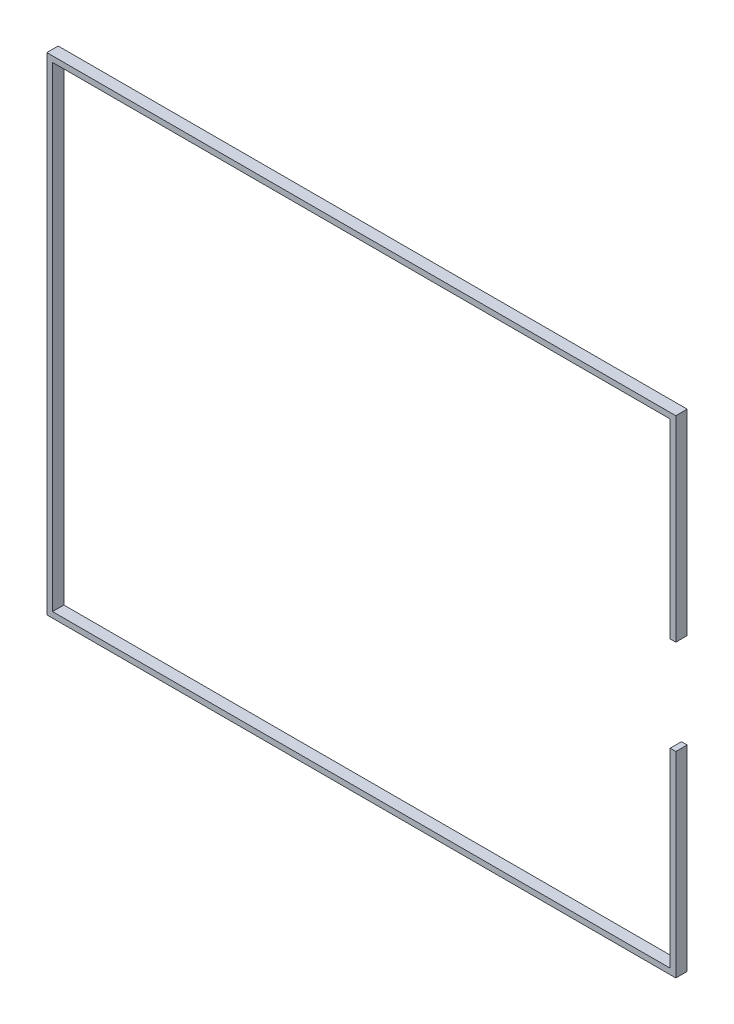
ISO-10303-21;
HEADER;
FILE_DESCRIPTION(('STEP AP214'),'2;1');
FILE_NAME('part.step','',(''),(''),'','','');
FILE_SCHEMA(('AUTOMOTIVE_DESIGN { 1 0 10303 214 1 1 1 1 }'));
ENDSEC;
DATA;
#1=APPLICATION_CONTEXT('core data for automotive mechanical design processes');
#2=APPLICATION_PROTOCOL_DEFINITION('international standard','automotive_design',2000,#1);
#3=PRODUCT_CONTEXT('',#1,'mechanical');
#4=PRODUCT('Part','Part','',(#3));
#5=PRODUCT_RELATED_PRODUCT_CATEGORY('part','',(#4));
#6=PRODUCT_DEFINITION_FORMATION('','',#4);
#7=PRODUCT_DEFINITION_CONTEXT('part definition',#1,'design');
#8=PRODUCT_DEFINITION('design','',#6,#7);
#9=PRODUCT_DEFINITION_SHAPE('','',#8);
#10=(LENGTH_UNIT() NAMED_UNIT(*) SI_UNIT(.MILLI.,.METRE.));
#11=(NAMED_UNIT(*) PLANE_ANGLE_UNIT() SI_UNIT($,.RADIAN.));
#12=(NAMED_UNIT(*) SI_UNIT($,.STERADIAN.) SOLID_ANGLE_UNIT());
#13=UNCERTAINTY_MEASURE_WITH_UNIT(LENGTH_MEASURE(1.E-05),#10,'distance_accuracy_value','');
#14=(GEOMETRIC_REPRESENTATION_CONTEXT(3) GLOBAL_UNCERTAINTY_ASSIGNED_CONTEXT((#13)) GLOBAL_UNIT_ASSIGNED_CONTEXT((#10,
#11,#12)) REPRESENTATION_CONTEXT('',''));
#15=CARTESIAN_POINT('',(0.,0.,0.));
#16=DIRECTION('',(0.,0.,1.));
#17=DIRECTION('',(1.,0.,0.));
#18=AXIS2_PLACEMENT_3D('',#15,#16,#17);
#19=CARTESIAN_POINT('',(166.1,0.,-5.));
#20=DIRECTION('',(1.,0.,0.));
#21=DIRECTION('',(0.,0.,-1.));
#22=AXIS2_PLACEMENT_3D('',#19,#20,#21);
#23=PLANE('',#22);
#24=DIRECTION('',(0.,-1.,0.));
#25=VECTOR('',#24,1.);
#26=CARTESIAN_POINT('',(166.1,0.,0.));
#27=LINE('',#26,#25);
#28=CARTESIAN_POINT('',(166.1,128.6,0.));
#29=VERTEX_POINT('',#28);
#30=CARTESIAN_POINT('',(166.1,25.,0.));
#31=VERTEX_POINT('',#30);
#32=EDGE_CURVE('E178',#29,#31,#27,.T.);
#33=ORIENTED_EDGE('',*,*,#32,.F.);
#34=DIRECTION('',(0.,0.,1.));
#35=VECTOR('',#34,1.);
#36=CARTESIAN_POINT('',(166.1,128.6,-5.));
#37=LINE('',#36,#35);
#38=CARTESIAN_POINT('',(166.1,128.6,6.));
#39=VERTEX_POINT('',#38);
#40=EDGE_CURVE('E210',#29,#39,#37,.T.);
#41=ORIENTED_EDGE('',*,*,#40,.T.);
#42=DIRECTION('',(0.,1.,0.));
#43=VECTOR('',#42,1.);
#44=CARTESIAN_POINT('',(166.1,0.,6.));
#45=LINE('',#44,#43);
#46=CARTESIAN_POINT('',(166.1,25.,6.));
#47=VERTEX_POINT('',#46);
#48=EDGE_CURVE('E187',#47,#39,#45,.T.);
#49=ORIENTED_EDGE('',*,*,#48,.F.);
#50=DIRECTION('',(0.,0.,-1.));
#51=VECTOR('',#50,1.);
#52=CARTESIAN_POINT('',(166.1,25.,6.));
#53=LINE('',#52,#51);
#54=EDGE_CURVE('E207',#47,#31,#53,.T.);
#55=ORIENTED_EDGE('',*,*,#54,.T.);
#56=EDGE_LOOP('',(#33,#41,#49,#55));
#57=FACE_BOUND('',#56,.T.);
#58=ADVANCED_FACE('F40',(#57),#23,.T.);
#59=CARTESIAN_POINT('',(0.,-128.6,-5.));
#60=DIRECTION('',(0.,-1.,0.));
#61=DIRECTION('',(0.,0.,-1.));
#62=AXIS2_PLACEMENT_3D('',#59,#60,#61);
#63=PLANE('',#62);
#64=DIRECTION('',(-1.,0.,0.));
#65=VECTOR('',#64,1.);
#66=CARTESIAN_POINT('',(0.,-128.6,0.));
#67=LINE('',#66,#65);
#68=CARTESIAN_POINT('',(166.1,-128.6,0.));
#69=VERTEX_POINT('',#68);
#70=CARTESIAN_POINT('',(-166.1,-128.6,0.));
#71=VERTEX_POINT('',#70);
#72=EDGE_CURVE('E177',#69,#71,#67,.T.);
#73=ORIENTED_EDGE('',*,*,#72,.F.);
#74=DIRECTION('',(0.,0.,1.));
#75=VECTOR('',#74,1.);
#76=CARTESIAN_POINT('',(166.1,-128.6,-5.));
#77=LINE('',#76,#75);
#78=CARTESIAN_POINT('',(166.1,-128.6,6.));
#79=VERTEX_POINT('',#78);
#80=EDGE_CURVE('E44',#69,#79,#77,.T.);
#81=ORIENTED_EDGE('',*,*,#80,.T.);
#82=DIRECTION('',(1.,0.,0.));
#83=VECTOR('',#82,1.);
#84=CARTESIAN_POINT('',(0.,-128.6,6.));
#85=LINE('',#84,#83);
#86=CARTESIAN_POINT('',(-166.1,-128.6,6.));
#87=VERTEX_POINT('',#86);
#88=EDGE_CURVE('E198',#87,#79,#85,.T.);
#89=ORIENTED_EDGE('',*,*,#88,.F.);
#90=DIRECTION('',(0.,0.,1.));
#91=VECTOR('',#90,1.);
#92=CARTESIAN_POINT('',(-166.1,-128.6,-5.));
#93=LINE('',#92,#91);
#94=EDGE_CURVE('E11',#71,#87,#93,.T.);
#95=ORIENTED_EDGE('',*,*,#94,.F.);
#96=EDGE_LOOP('',(#73,#81,#89,#95));
#97=FACE_BOUND('',#96,.T.);
#98=ADVANCED_FACE('F42',(#97),#63,.T.);
#99=CARTESIAN_POINT('',(-166.1,0.,-5.));
#100=DIRECTION('',(-1.,0.,0.));
#101=DIRECTION('',(0.,0.,1.));
#102=AXIS2_PLACEMENT_3D('',#99,#100,#101);
#103=PLANE('',#102);
#104=DIRECTION('',(0.,1.,0.));
#105=VECTOR('',#104,1.);
#106=CARTESIAN_POINT('',(-166.1,0.,0.));
#107=LINE('',#106,#105);
#108=CARTESIAN_POINT('',(-166.1,128.6,0.));
#109=VERTEX_POINT('',#108);
#110=EDGE_CURVE('E180',#71,#109,#107,.T.);
#111=ORIENTED_EDGE('',*,*,#110,.F.);
#112=ORIENTED_EDGE('',*,*,#94,.T.);
#113=DIRECTION('',(0.,-1.,0.));
#114=VECTOR('',#113,1.);
#115=CARTESIAN_POINT('',(-166.1,0.,6.));
#116=LINE('',#115,#114);
#117=CARTESIAN_POINT('',(-166.1,128.6,6.));
#118=VERTEX_POINT('',#117);
#119=EDGE_CURVE('E195',#118,#87,#116,.T.);
#120=ORIENTED_EDGE('',*,*,#119,.F.);
#121=DIRECTION('',(0.,0.,1.));
#122=VECTOR('',#121,1.);
#123=CARTESIAN_POINT('',(-166.1,128.6,-5.));
#124=LINE('',#123,#122);
#125=EDGE_CURVE('E49',#109,#118,#124,.T.);
#126=ORIENTED_EDGE('',*,*,#125,.F.);
#127=EDGE_LOOP('',(#111,#112,#120,#126));
#128=FACE_BOUND('',#127,.T.);
#129=ADVANCED_FACE('F233',(#128),#103,.T.);
#130=CARTESIAN_POINT('',(0.,128.6,-5.));
#131=DIRECTION('',(0.,-1.,0.));
#132=DIRECTION('',(0.,0.,-1.));
#133=AXIS2_PLACEMENT_3D('',#130,#131,#132);
#134=PLANE('',#133);
#135=ORIENTED_EDGE('',*,*,#40,.F.);
#136=DIRECTION('',(-1.,0.,0.));
#137=VECTOR('',#136,1.);
#138=CARTESIAN_POINT('',(0.,128.6,0.));
#139=LINE('',#138,#137);
#140=EDGE_CURVE('E182',#29,#109,#139,.T.);
#141=ORIENTED_EDGE('',*,*,#140,.T.);
#142=ORIENTED_EDGE('',*,*,#125,.T.);
#143=DIRECTION('',(-1.,0.,0.));
#144=VECTOR('',#143,1.);
#145=CARTESIAN_POINT('',(0.,128.6,6.));
#146=LINE('',#145,#144);
#147=EDGE_CURVE('E191',#39,#118,#146,.T.);
#148=ORIENTED_EDGE('',*,*,#147,.F.);
#149=EDGE_LOOP('',(#135,#141,#142,#148));
#150=FACE_BOUND('',#149,.T.);
#151=ADVANCED_FACE('F236',(#150),#134,.F.);
#152=CARTESIAN_POINT('',(166.1,-25.,0.));
#153=VERTEX_POINT('',#152);
#154=EDGE_CURVE('E168',#153,#69,#27,.T.);
#155=ORIENTED_EDGE('',*,*,#154,.F.);
#156=DIRECTION('',(0.,0.,-1.));
#157=VECTOR('',#156,1.);
#158=CARTESIAN_POINT('',(166.1,-25.,6.));
#159=LINE('',#158,#157);
#160=CARTESIAN_POINT('',(166.1,-25.,6.));
#161=VERTEX_POINT('',#160);
#162=EDGE_CURVE('E202',#161,#153,#159,.T.);
#163=ORIENTED_EDGE('',*,*,#162,.F.);
#164=EDGE_CURVE('E192',#79,#161,#45,.T.);
#165=ORIENTED_EDGE('',*,*,#164,.F.);
#166=ORIENTED_EDGE('',*,*,#80,.F.);
#167=EDGE_LOOP('',(#155,#163,#165,#166));
#168=FACE_BOUND('',#167,.T.);
#169=ADVANCED_FACE('F228',(#168),#23,.T.);
#170=CARTESIAN_POINT('',(0.,25.,6.));
#171=DIRECTION('',(0.,1.,0.));
#172=DIRECTION('',(0.,0.,1.));
#173=AXIS2_PLACEMENT_3D('',#170,#171,#172);
#174=PLANE('',#173);
#175=DIRECTION('',(1.,0.,0.));
#176=VECTOR('',#175,1.);
#177=CARTESIAN_POINT('',(0.,25.,6.));
#178=LINE('',#177,#176);
#179=CARTESIAN_POINT('',(163.1,25.,6.));
#180=VERTEX_POINT('',#179);
#181=EDGE_CURVE('E185',#180,#47,#178,.T.);
#182=ORIENTED_EDGE('',*,*,#181,.F.);
#183=DIRECTION('',(0.,0.,1.));
#184=VECTOR('',#183,1.);
#185=CARTESIAN_POINT('',(163.1,25.,0.));
#186=LINE('',#185,#184);
#187=CARTESIAN_POINT('',(163.1,25.,0.));
#188=VERTEX_POINT('',#187);
#189=EDGE_CURVE('E173',#188,#180,#186,.T.);
#190=ORIENTED_EDGE('',*,*,#189,.F.);
#191=DIRECTION('',(1.,0.,0.));
#192=VECTOR('',#191,1.);
#193=CARTESIAN_POINT('',(0.,25.,0.));
#194=LINE('',#193,#192);
#195=EDGE_CURVE('E203',#188,#31,#194,.T.);
#196=ORIENTED_EDGE('',*,*,#195,.T.);
#197=ORIENTED_EDGE('',*,*,#54,.F.);
#198=EDGE_LOOP('',(#182,#190,#196,#197));
#199=FACE_BOUND('',#198,.T.);
#200=ADVANCED_FACE('F241',(#199),#174,.F.);
#201=CARTESIAN_POINT('',(0.,-25.,6.));
#202=DIRECTION('',(0.,1.,0.));
#203=DIRECTION('',(0.,0.,1.));
#204=AXIS2_PLACEMENT_3D('',#201,#202,#203);
#205=PLANE('',#204);
#206=DIRECTION('',(0.,0.,1.));
#207=VECTOR('',#206,1.);
#208=CARTESIAN_POINT('',(163.1,-25.,0.));
#209=LINE('',#208,#207);
#210=CARTESIAN_POINT('',(163.1,-25.,0.));
#211=VERTEX_POINT('',#210);
#212=CARTESIAN_POINT('',(163.1,-25.,6.));
#213=VERTEX_POINT('',#212);
#214=EDGE_CURVE('E57',#211,#213,#209,.T.);
#215=ORIENTED_EDGE('',*,*,#214,.T.);
#216=DIRECTION('',(1.,0.,0.));
#217=VECTOR('',#216,1.);
#218=CARTESIAN_POINT('',(0.,-25.,6.));
#219=LINE('',#218,#217);
#220=EDGE_CURVE('E64',#213,#161,#219,.T.);
#221=ORIENTED_EDGE('',*,*,#220,.T.);
#222=ORIENTED_EDGE('',*,*,#162,.T.);
#223=DIRECTION('',(1.,0.,0.));
#224=VECTOR('',#223,1.);
#225=CARTESIAN_POINT('',(0.,-25.,0.));
#226=LINE('',#225,#224);
#227=EDGE_CURVE('E188',#211,#153,#226,.T.);
#228=ORIENTED_EDGE('',*,*,#227,.F.);
#229=EDGE_LOOP('',(#215,#221,#222,#228));
#230=FACE_BOUND('',#229,.T.);
#231=ADVANCED_FACE('F229',(#230),#205,.T.);
#232=CARTESIAN_POINT('',(0.,0.,6.));
#233=DIRECTION('',(0.,0.,1.));
#234=DIRECTION('',(1.,0.,0.));
#235=AXIS2_PLACEMENT_3D('',#232,#233,#234);
#236=PLANE('',#235);
#237=DIRECTION('',(0.,1.,0.));
#238=VECTOR('',#237,1.);
#239=CARTESIAN_POINT('',(163.1,0.,6.));
#240=LINE('',#239,#238);
#241=CARTESIAN_POINT('',(163.1,125.6,6.));
#242=VERTEX_POINT('',#241);
#243=EDGE_CURVE('E163',#180,#242,#240,.T.);
#244=ORIENTED_EDGE('',*,*,#243,.F.);
#245=ORIENTED_EDGE('',*,*,#181,.T.);
#246=ORIENTED_EDGE('',*,*,#48,.T.);
#247=ORIENTED_EDGE('',*,*,#147,.T.);
#248=ORIENTED_EDGE('',*,*,#119,.T.);
#249=ORIENTED_EDGE('',*,*,#88,.T.);
#250=ORIENTED_EDGE('',*,*,#164,.T.);
#251=ORIENTED_EDGE('',*,*,#220,.F.);
#252=CARTESIAN_POINT('',(163.1,-125.6,6.));
#253=VERTEX_POINT('',#252);
#254=EDGE_CURVE('E161',#253,#213,#240,.T.);
#255=ORIENTED_EDGE('',*,*,#254,.F.);
#256=DIRECTION('',(1.,0.,0.));
#257=VECTOR('',#256,1.);
#258=CARTESIAN_POINT('',(0.,-125.6,6.));
#259=LINE('',#258,#257);
#260=CARTESIAN_POINT('',(-163.1,-125.6,6.));
#261=VERTEX_POINT('',#260);
#262=EDGE_CURVE('E138',#261,#253,#259,.T.);
#263=ORIENTED_EDGE('',*,*,#262,.F.);
#264=DIRECTION('',(0.,1.,0.));
#265=VECTOR('',#264,1.);
#266=CARTESIAN_POINT('',(-163.1,0.,6.));
#267=LINE('',#266,#265);
#268=CARTESIAN_POINT('',(-163.1,125.6,6.));
#269=VERTEX_POINT('',#268);
#270=EDGE_CURVE('E151',#261,#269,#267,.T.);
#271=ORIENTED_EDGE('',*,*,#270,.T.);
#272=DIRECTION('',(1.,0.,0.));
#273=VECTOR('',#272,1.);
#274=CARTESIAN_POINT('',(0.,125.6,6.));
#275=LINE('',#274,#273);
#276=EDGE_CURVE('E154',#269,#242,#275,.T.);
#277=ORIENTED_EDGE('',*,*,#276,.T.);
#278=EDGE_LOOP('',(#244,#245,#246,#247,#248,#249,#250,#251,#255,#263,#271,#277));
#279=FACE_BOUND('',#278,.T.);
#280=ADVANCED_FACE('F225',(#279),#236,.T.);
#281=CARTESIAN_POINT('',(0.,0.,0.));
#282=DIRECTION('',(0.,0.,1.));
#283=DIRECTION('',(1.,0.,0.));
#284=AXIS2_PLACEMENT_3D('',#281,#282,#283);
#285=PLANE('',#284);
#286=ORIENTED_EDGE('',*,*,#195,.F.);
#287=DIRECTION('',(0.,1.,0.));
#288=VECTOR('',#287,1.);
#289=CARTESIAN_POINT('',(163.1,0.,0.));
#290=LINE('',#289,#288);
#291=CARTESIAN_POINT('',(163.1,125.6,0.));
#292=VERTEX_POINT('',#291);
#293=EDGE_CURVE('E146',#188,#292,#290,.T.);
#294=ORIENTED_EDGE('',*,*,#293,.T.);
#295=DIRECTION('',(1.,0.,0.));
#296=VECTOR('',#295,1.);
#297=CARTESIAN_POINT('',(0.,125.6,0.));
#298=LINE('',#297,#296);
#299=CARTESIAN_POINT('',(-163.1,125.6,0.));
#300=VERTEX_POINT('',#299);
#301=EDGE_CURVE('E157',#300,#292,#298,.T.);
#302=ORIENTED_EDGE('',*,*,#301,.F.);
#303=DIRECTION('',(0.,1.,0.));
#304=VECTOR('',#303,1.);
#305=CARTESIAN_POINT('',(-163.1,0.,0.));
#306=LINE('',#305,#304);
#307=CARTESIAN_POINT('',(-163.1,-125.6,0.));
#308=VERTEX_POINT('',#307);
#309=EDGE_CURVE('E140',#308,#300,#306,.T.);
#310=ORIENTED_EDGE('',*,*,#309,.F.);
#311=DIRECTION('',(1.,0.,0.));
#312=VECTOR('',#311,1.);
#313=CARTESIAN_POINT('',(0.,-125.6,0.));
#314=LINE('',#313,#312);
#315=CARTESIAN_POINT('',(163.1,-125.6,0.));
#316=VERTEX_POINT('',#315);
#317=EDGE_CURVE('E135',#308,#316,#314,.T.);
#318=ORIENTED_EDGE('',*,*,#317,.T.);
#319=EDGE_CURVE('E142',#316,#211,#290,.T.);
#320=ORIENTED_EDGE('',*,*,#319,.T.);
#321=ORIENTED_EDGE('',*,*,#227,.T.);
#322=ORIENTED_EDGE('',*,*,#154,.T.);
#323=ORIENTED_EDGE('',*,*,#72,.T.);
#324=ORIENTED_EDGE('',*,*,#110,.T.);
#325=ORIENTED_EDGE('',*,*,#140,.F.);
#326=ORIENTED_EDGE('',*,*,#32,.T.);
#327=EDGE_LOOP('',(#286,#294,#302,#310,#318,#320,#321,#322,#323,#324,#325,#326));
#328=FACE_BOUND('',#327,.T.);
#329=ADVANCED_FACE('F149',(#328),#285,.F.);
#330=CARTESIAN_POINT('',(0.,-125.6,0.));
#331=DIRECTION('',(0.,-1.,0.));
#332=DIRECTION('',(0.,0.,-1.));
#333=AXIS2_PLACEMENT_3D('',#330,#331,#332);
#334=PLANE('',#333);
#335=ORIENTED_EDGE('',*,*,#262,.T.);
#336=DIRECTION('',(0.,0.,1.));
#337=VECTOR('',#336,1.);
#338=CARTESIAN_POINT('',(163.1,-125.6,0.));
#339=LINE('',#338,#337);
#340=EDGE_CURVE('E132',#316,#253,#339,.T.);
#341=ORIENTED_EDGE('',*,*,#340,.F.);
#342=ORIENTED_EDGE('',*,*,#317,.F.);
#343=DIRECTION('',(0.,0.,1.));
#344=VECTOR('',#343,1.);
#345=CARTESIAN_POINT('',(-163.1,-125.6,0.));
#346=LINE('',#345,#344);
#347=EDGE_CURVE('E166',#308,#261,#346,.T.);
#348=ORIENTED_EDGE('',*,*,#347,.T.);
#349=EDGE_LOOP('',(#335,#341,#342,#348));
#350=FACE_BOUND('',#349,.T.);
#351=ADVANCED_FACE('F133',(#350),#334,.F.);
#352=CARTESIAN_POINT('',(-163.1,0.,0.));
#353=DIRECTION('',(1.,0.,0.));
#354=DIRECTION('',(0.,0.,-1.));
#355=AXIS2_PLACEMENT_3D('',#352,#353,#354);
#356=PLANE('',#355);
#357=ORIENTED_EDGE('',*,*,#270,.F.);
#358=ORIENTED_EDGE('',*,*,#347,.F.);
#359=ORIENTED_EDGE('',*,*,#309,.T.);
#360=DIRECTION('',(0.,0.,1.));
#361=VECTOR('',#360,1.);
#362=CARTESIAN_POINT('',(-163.1,125.6,0.));
#363=LINE('',#362,#361);
#364=EDGE_CURVE('E169',#300,#269,#363,.T.);
#365=ORIENTED_EDGE('',*,*,#364,.T.);
#366=EDGE_LOOP('',(#357,#358,#359,#365));
#367=FACE_BOUND('',#366,.T.);
#368=ADVANCED_FACE('F254',(#367),#356,.T.);
#369=CARTESIAN_POINT('',(0.,125.6,0.));
#370=DIRECTION('',(0.,-1.,0.));
#371=DIRECTION('',(0.,0.,-1.));
#372=AXIS2_PLACEMENT_3D('',#369,#370,#371);
#373=PLANE('',#372);
#374=ORIENTED_EDGE('',*,*,#276,.F.);
#375=ORIENTED_EDGE('',*,*,#364,.F.);
#376=ORIENTED_EDGE('',*,*,#301,.T.);
#377=DIRECTION('',(0.,0.,1.));
#378=VECTOR('',#377,1.);
#379=CARTESIAN_POINT('',(163.1,125.6,0.));
#380=LINE('',#379,#378);
#381=EDGE_CURVE('E171',#292,#242,#380,.T.);
#382=ORIENTED_EDGE('',*,*,#381,.T.);
#383=EDGE_LOOP('',(#374,#375,#376,#382));
#384=FACE_BOUND('',#383,.T.);
#385=ADVANCED_FACE('F250',(#384),#373,.T.);
#386=CARTESIAN_POINT('',(163.1,0.,0.));
#387=DIRECTION('',(1.,0.,0.));
#388=DIRECTION('',(0.,0.,-1.));
#389=AXIS2_PLACEMENT_3D('',#386,#387,#388);
#390=PLANE('',#389);
#391=ORIENTED_EDGE('',*,*,#243,.T.);
#392=ORIENTED_EDGE('',*,*,#381,.F.);
#393=ORIENTED_EDGE('',*,*,#293,.F.);
#394=ORIENTED_EDGE('',*,*,#189,.T.);
#395=EDGE_LOOP('',(#391,#392,#393,#394));
#396=FACE_BOUND('',#395,.T.);
#397=ADVANCED_FACE('F247',(#396),#390,.F.);
#398=ORIENTED_EDGE('',*,*,#254,.T.);
#399=ORIENTED_EDGE('',*,*,#214,.F.);
#400=ORIENTED_EDGE('',*,*,#319,.F.);
#401=ORIENTED_EDGE('',*,*,#340,.T.);
#402=EDGE_LOOP('',(#398,#399,#400,#401));
#403=FACE_BOUND('',#402,.T.);
#404=ADVANCED_FACE('F143',(#403),#390,.F.);
#405=CLOSED_SHELL('',(#58,#98,#129,#151,#169,#200,#231,#280,#329,#351,#368,#385,#397,#404));
#406=MANIFOLD_SOLID_BREP('B2',#405);
#407=ADVANCED_BREP_SHAPE_REPRESENTATION('',(#18,#406),#14);
#408=SHAPE_DEFINITION_REPRESENTATION(#9,#407);
ENDSEC;
END-ISO-10303-21;
